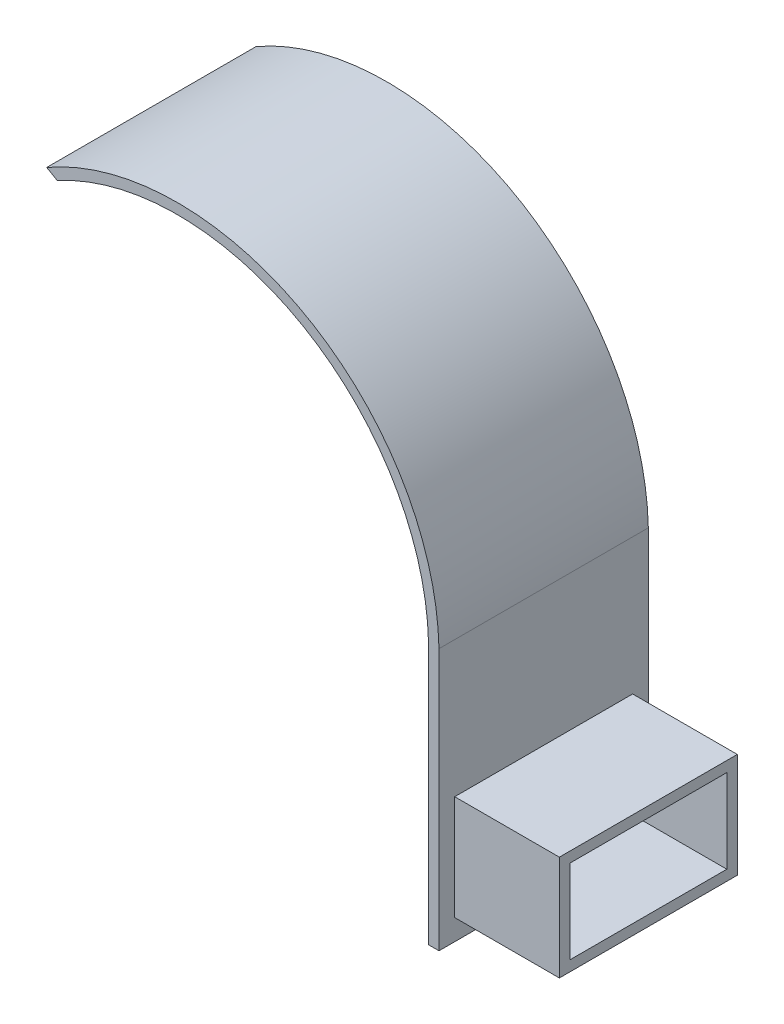
ISO-10303-21;
HEADER;
FILE_DESCRIPTION(('STEP AP214'),'2;1');
FILE_NAME('part.step','',(''),(''),'','','');
FILE_SCHEMA(('AUTOMOTIVE_DESIGN { 1 0 10303 214 1 1 1 1 }'));
ENDSEC;
DATA;
#1=APPLICATION_CONTEXT('core data for automotive mechanical design processes');
#2=APPLICATION_PROTOCOL_DEFINITION('international standard','automotive_design',2000,#1);
#3=PRODUCT_CONTEXT('',#1,'mechanical');
#4=PRODUCT('Part','Part','',(#3));
#5=PRODUCT_RELATED_PRODUCT_CATEGORY('part','',(#4));
#6=PRODUCT_DEFINITION_FORMATION('','',#4);
#7=PRODUCT_DEFINITION_CONTEXT('part definition',#1,'design');
#8=PRODUCT_DEFINITION('design','',#6,#7);
#9=PRODUCT_DEFINITION_SHAPE('','',#8);
#10=(LENGTH_UNIT() NAMED_UNIT(*) SI_UNIT(.MILLI.,.METRE.));
#11=(NAMED_UNIT(*) PLANE_ANGLE_UNIT() SI_UNIT($,.RADIAN.));
#12=(NAMED_UNIT(*) SI_UNIT($,.STERADIAN.) SOLID_ANGLE_UNIT());
#13=UNCERTAINTY_MEASURE_WITH_UNIT(LENGTH_MEASURE(1.E-05),#10,'distance_accuracy_value','');
#14=(GEOMETRIC_REPRESENTATION_CONTEXT(3) GLOBAL_UNCERTAINTY_ASSIGNED_CONTEXT((#13)) GLOBAL_UNIT_ASSIGNED_CONTEXT((#10,
#11,#12)) REPRESENTATION_CONTEXT('',''));
#15=CARTESIAN_POINT('',(0.,0.,0.));
#16=DIRECTION('',(0.,0.,1.));
#17=DIRECTION('',(1.,0.,0.));
#18=AXIS2_PLACEMENT_3D('',#15,#16,#17);
#19=CARTESIAN_POINT('',(24.9932296828144,-24.4182182350012,20.));
#20=DIRECTION('',(-1.,0.,0.));
#21=DIRECTION('',(0.,0.,1.));
#22=AXIS2_PLACEMENT_3D('',#19,#20,#21);
#23=PLANE('',#22);
#24=DIRECTION('',(0.,0.,-1.));
#25=VECTOR('',#24,1.);
#26=CARTESIAN_POINT('',(24.9932296828144,0.581781764998821,20.));
#27=LINE('',#26,#25);
#28=CARTESIAN_POINT('',(24.9932296828144,0.581781764998821,20.));
#29=VERTEX_POINT('',#28);
#30=CARTESIAN_POINT('',(24.9932296828144,0.581781764998821,0.));
#31=VERTEX_POINT('',#30);
#32=EDGE_CURVE('E269',#29,#31,#27,.T.);
#33=ORIENTED_EDGE('',*,*,#32,.F.);
#34=DIRECTION('',(0.,1.,0.));
#35=VECTOR('',#34,1.);
#36=CARTESIAN_POINT('',(24.9932296828144,-24.4182182350012,20.));
#37=LINE('',#36,#35);
#38=CARTESIAN_POINT('',(24.9932296828144,-24.4182182350012,20.));
#39=VERTEX_POINT('',#38);
#40=EDGE_CURVE('E257',#39,#29,#37,.T.);
#41=ORIENTED_EDGE('',*,*,#40,.F.);
#42=DIRECTION('',(0.,0.,1.));
#43=VECTOR('',#42,1.);
#44=CARTESIAN_POINT('',(24.9932296828144,-24.4182182350012,20.));
#45=LINE('',#44,#43);
#46=CARTESIAN_POINT('',(24.9932296828144,-24.4182182350012,0.));
#47=VERTEX_POINT('',#46);
#48=EDGE_CURVE('E247',#47,#39,#45,.T.);
#49=ORIENTED_EDGE('',*,*,#48,.F.);
#50=DIRECTION('',(0.,1.,0.));
#51=VECTOR('',#50,1.);
#52=CARTESIAN_POINT('',(24.9932296828144,-24.4182182350012,0.));
#53=LINE('',#52,#51);
#54=EDGE_CURVE('E261',#47,#31,#53,.T.);
#55=ORIENTED_EDGE('',*,*,#54,.T.);
#56=EDGE_LOOP('',(#33,#41,#49,#55));
#57=FACE_BOUND('',#56,.T.);
#58=DIRECTION('',(0.,-1.,0.));
#59=VECTOR('',#58,1.);
#60=CARTESIAN_POINT('',(24.9932296828144,-22.4182182350012,18.5));
#61=LINE('',#60,#59);
#62=CARTESIAN_POINT('',(24.9932296828144,-12.4182182350012,18.5));
#63=VERTEX_POINT('',#62);
#64=CARTESIAN_POINT('',(24.9932296828144,-22.4182182350012,18.5));
#65=VERTEX_POINT('',#64);
#66=EDGE_CURVE('E180',#63,#65,#61,.T.);
#67=ORIENTED_EDGE('',*,*,#66,.F.);
#68=DIRECTION('',(0.,0.,1.));
#69=VECTOR('',#68,1.);
#70=CARTESIAN_POINT('',(24.9932296828144,-12.4182182350012,18.5));
#71=LINE('',#70,#69);
#72=CARTESIAN_POINT('',(24.9932296828144,-12.4182182350012,1.5));
#73=VERTEX_POINT('',#72);
#74=EDGE_CURVE('E186',#73,#63,#71,.T.);
#75=ORIENTED_EDGE('',*,*,#74,.F.);
#76=DIRECTION('',(0.,1.,0.));
#77=VECTOR('',#76,1.);
#78=CARTESIAN_POINT('',(24.9932296828144,-22.4182182350012,1.5));
#79=LINE('',#78,#77);
#80=CARTESIAN_POINT('',(24.9932296828144,-22.4182182350012,1.5));
#81=VERTEX_POINT('',#80);
#82=EDGE_CURVE('E66',#81,#73,#79,.T.);
#83=ORIENTED_EDGE('',*,*,#82,.F.);
#84=DIRECTION('',(0.,0.,-1.));
#85=VECTOR('',#84,1.);
#86=CARTESIAN_POINT('',(24.9932296828144,-22.4182182350012,18.5));
#87=LINE('',#86,#85);
#88=EDGE_CURVE('E61',#65,#81,#87,.T.);
#89=ORIENTED_EDGE('',*,*,#88,.F.);
#90=EDGE_LOOP('',(#67,#75,#83,#89));
#91=FACE_BOUND('',#90,.T.);
#92=ADVANCED_FACE('F45',(#57,#91),#23,.F.);
#93=CARTESIAN_POINT('',(0.,0.,20.));
#94=DIRECTION('',(0.,0.,1.));
#95=DIRECTION('',(1.,0.,0.));
#96=AXIS2_PLACEMENT_3D('',#93,#94,#95);
#97=PLANE('',#96);
#98=CARTESIAN_POINT('',(0.,0.,20.));
#99=DIRECTION('',(0.,0.,1.));
#100=DIRECTION('',(1.,0.,0.));
#101=AXIS2_PLACEMENT_3D('',#98,#99,#100);
#102=CIRCLE('',#101,24.);
#103=CARTESIAN_POINT('',(23.9929475050048,0.581781764998821,20.));
#104=VERTEX_POINT('',#103);
#105=CARTESIAN_POINT('',(-11.4813465548932,21.0755469985109,20.));
#106=VERTEX_POINT('',#105);
#107=EDGE_CURVE('E285',#104,#106,#102,.T.);
#108=ORIENTED_EDGE('',*,*,#107,.F.);
#109=DIRECTION('',(0.,1.,0.));
#110=VECTOR('',#109,1.);
#111=CARTESIAN_POINT('',(23.9929475050048,-24.4182182350012,20.));
#112=LINE('',#111,#110);
#113=CARTESIAN_POINT('',(23.9929475050048,-24.4182182350012,20.));
#114=VERTEX_POINT('',#113);
#115=EDGE_CURVE('E253',#114,#104,#112,.T.);
#116=ORIENTED_EDGE('',*,*,#115,.F.);
#117=DIRECTION('',(-1.,0.,0.));
#118=VECTOR('',#117,1.);
#119=CARTESIAN_POINT('',(23.9929475050048,-24.4182182350012,20.));
#120=LINE('',#119,#118);
#121=EDGE_CURVE('E250',#39,#114,#120,.T.);
#122=ORIENTED_EDGE('',*,*,#121,.F.);
#123=ORIENTED_EDGE('',*,*,#40,.T.);
#124=CARTESIAN_POINT('',(0.,0.,20.));
#125=DIRECTION('',(0.,0.,1.));
#126=DIRECTION('',(1.,0.,0.));
#127=AXIS2_PLACEMENT_3D('',#124,#125,#126);
#128=CIRCLE('',#127,25.);
#129=CARTESIAN_POINT('',(-12.4883990498885,21.6573287635097,20.));
#130=VERTEX_POINT('',#129);
#131=EDGE_CURVE('E293',#29,#130,#128,.T.);
#132=ORIENTED_EDGE('',*,*,#131,.T.);
#133=DIRECTION('',(-0.86589143718931,0.500231965194379,0.));
#134=VECTOR('',#133,1.);
#135=CARTESIAN_POINT('',(-12.4883990498885,21.6573287635097,20.));
#136=LINE('',#135,#134);
#137=EDGE_CURVE('E272',#106,#130,#136,.T.);
#138=ORIENTED_EDGE('',*,*,#137,.F.);
#139=EDGE_LOOP('',(#108,#116,#122,#123,#132,#138));
#140=FACE_BOUND('',#139,.T.);
#141=ADVANCED_FACE('F305',(#140),#97,.T.);
#142=CARTESIAN_POINT('',(0.,0.,0.));
#143=DIRECTION('',(0.,0.,1.));
#144=DIRECTION('',(1.,0.,0.));
#145=AXIS2_PLACEMENT_3D('',#142,#143,#144);
#146=PLANE('',#145);
#147=CARTESIAN_POINT('',(0.,0.,0.));
#148=DIRECTION('',(0.,0.,1.));
#149=DIRECTION('',(1.,0.,0.));
#150=AXIS2_PLACEMENT_3D('',#147,#148,#149);
#151=CIRCLE('',#150,25.);
#152=CARTESIAN_POINT('',(-12.4883990498885,21.6573287635097,0.));
#153=VERTEX_POINT('',#152);
#154=EDGE_CURVE('E289',#31,#153,#151,.T.);
#155=ORIENTED_EDGE('',*,*,#154,.F.);
#156=ORIENTED_EDGE('',*,*,#54,.F.);
#157=DIRECTION('',(1.,0.,0.));
#158=VECTOR('',#157,1.);
#159=CARTESIAN_POINT('',(23.9929475050048,-24.4182182350012,0.));
#160=LINE('',#159,#158);
#161=CARTESIAN_POINT('',(23.9929475050048,-24.4182182350012,0.));
#162=VERTEX_POINT('',#161);
#163=EDGE_CURVE('E244',#162,#47,#160,.T.);
#164=ORIENTED_EDGE('',*,*,#163,.F.);
#165=DIRECTION('',(0.,1.,0.));
#166=VECTOR('',#165,1.);
#167=CARTESIAN_POINT('',(23.9929475050048,-24.4182182350012,0.));
#168=LINE('',#167,#166);
#169=CARTESIAN_POINT('',(23.9929475050048,0.581781764998821,0.));
#170=VERTEX_POINT('',#169);
#171=EDGE_CURVE('E265',#162,#170,#168,.T.);
#172=ORIENTED_EDGE('',*,*,#171,.T.);
#173=CARTESIAN_POINT('',(0.,0.,0.));
#174=DIRECTION('',(0.,0.,1.));
#175=DIRECTION('',(1.,0.,0.));
#176=AXIS2_PLACEMENT_3D('',#173,#174,#175);
#177=CIRCLE('',#176,24.);
#178=CARTESIAN_POINT('',(-11.4813465548932,21.0755469985109,0.));
#179=VERTEX_POINT('',#178);
#180=EDGE_CURVE('E284',#170,#179,#177,.T.);
#181=ORIENTED_EDGE('',*,*,#180,.T.);
#182=DIRECTION('',(-0.86589143718931,0.500231965194379,0.));
#183=VECTOR('',#182,1.);
#184=CARTESIAN_POINT('',(-12.4883990498885,21.6573287635097,0.));
#185=LINE('',#184,#183);
#186=EDGE_CURVE('E273',#179,#153,#185,.T.);
#187=ORIENTED_EDGE('',*,*,#186,.T.);
#188=EDGE_LOOP('',(#155,#156,#164,#172,#181,#187));
#189=FACE_BOUND('',#188,.T.);
#190=ADVANCED_FACE('F324',(#189),#146,.F.);
#191=CARTESIAN_POINT('',(0.,0.,20.));
#192=DIRECTION('',(0.,0.,-1.));
#193=DIRECTION('',(-1.,0.,0.));
#194=AXIS2_PLACEMENT_3D('',#191,#192,#193);
#195=CYLINDRICAL_SURFACE('',#194,25.);
#196=ORIENTED_EDGE('',*,*,#131,.F.);
#197=ORIENTED_EDGE('',*,*,#32,.T.);
#198=ORIENTED_EDGE('',*,*,#154,.T.);
#199=DIRECTION('',(0.,0.,1.));
#200=VECTOR('',#199,1.);
#201=CARTESIAN_POINT('',(-12.4883990498885,21.6573287635097,0.));
#202=LINE('',#201,#200);
#203=EDGE_CURVE('E277',#153,#130,#202,.T.);
#204=ORIENTED_EDGE('',*,*,#203,.T.);
#205=EDGE_LOOP('',(#196,#197,#198,#204));
#206=FACE_BOUND('',#205,.T.);
#207=ADVANCED_FACE('F47',(#206),#195,.T.);
#208=CARTESIAN_POINT('',(0.,0.,20.));
#209=DIRECTION('',(0.,0.,-1.));
#210=DIRECTION('',(-1.,0.,0.));
#211=AXIS2_PLACEMENT_3D('',#208,#209,#210);
#212=CYLINDRICAL_SURFACE('',#211,24.);
#213=DIRECTION('',(0.,0.,-1.));
#214=VECTOR('',#213,1.);
#215=CARTESIAN_POINT('',(23.9929475050048,0.581781764998821,20.));
#216=LINE('',#215,#214);
#217=EDGE_CURVE('E11',#104,#170,#216,.T.);
#218=ORIENTED_EDGE('',*,*,#217,.F.);
#219=ORIENTED_EDGE('',*,*,#107,.T.);
#220=DIRECTION('',(0.,0.,-1.));
#221=VECTOR('',#220,1.);
#222=CARTESIAN_POINT('',(-11.4813465548932,21.0755469985109,20.));
#223=LINE('',#222,#221);
#224=EDGE_CURVE('E54',#179,#106,#223,.F.);
#225=ORIENTED_EDGE('',*,*,#224,.F.);
#226=ORIENTED_EDGE('',*,*,#180,.F.);
#227=EDGE_LOOP('',(#218,#219,#225,#226));
#228=FACE_BOUND('',#227,.T.);
#229=ADVANCED_FACE('F308',(#228),#212,.F.);
#230=CARTESIAN_POINT('',(-12.4883990498885,21.6573287635097,0.));
#231=DIRECTION('',(0.500231965194379,0.86589143718931,0.));
#232=DIRECTION('',(-0.86589143718931,0.50023196519438,0.));
#233=AXIS2_PLACEMENT_3D('',#230,#231,#232);
#234=PLANE('',#233);
#235=ORIENTED_EDGE('',*,*,#224,.T.);
#236=ORIENTED_EDGE('',*,*,#137,.T.);
#237=ORIENTED_EDGE('',*,*,#203,.F.);
#238=ORIENTED_EDGE('',*,*,#186,.F.);
#239=EDGE_LOOP('',(#235,#236,#237,#238));
#240=FACE_BOUND('',#239,.T.);
#241=ADVANCED_FACE('F301',(#240),#234,.F.);
#242=CARTESIAN_POINT('',(23.9929475050048,-24.4182182350012,20.));
#243=DIRECTION('',(1.,0.,0.));
#244=DIRECTION('',(0.,0.,-1.));
#245=AXIS2_PLACEMENT_3D('',#242,#243,#244);
#246=PLANE('',#245);
#247=DIRECTION('',(0.,0.,1.));
#248=VECTOR('',#247,1.);
#249=CARTESIAN_POINT('',(23.9929475050048,-13.4182182350012,20.));
#250=LINE('',#249,#248);
#251=CARTESIAN_POINT('',(23.9929475050048,-13.4182182350012,2.5));
#252=VERTEX_POINT('',#251);
#253=CARTESIAN_POINT('',(23.9929475050048,-13.4182182350012,17.5));
#254=VERTEX_POINT('',#253);
#255=EDGE_CURVE('E153',#252,#254,#250,.T.);
#256=ORIENTED_EDGE('',*,*,#255,.T.);
#257=DIRECTION('',(0.,-1.,0.));
#258=VECTOR('',#257,1.);
#259=CARTESIAN_POINT('',(23.9929475050048,-24.4182182350012,17.5));
#260=LINE('',#259,#258);
#261=CARTESIAN_POINT('',(23.9929475050048,-21.4182182350012,17.5));
#262=VERTEX_POINT('',#261);
#263=EDGE_CURVE('E236',#254,#262,#260,.T.);
#264=ORIENTED_EDGE('',*,*,#263,.T.);
#265=DIRECTION('',(0.,0.,-1.));
#266=VECTOR('',#265,1.);
#267=CARTESIAN_POINT('',(23.9929475050048,-21.4182182350012,20.));
#268=LINE('',#267,#266);
#269=CARTESIAN_POINT('',(23.9929475050048,-21.4182182350012,2.5));
#270=VERTEX_POINT('',#269);
#271=EDGE_CURVE('E222',#262,#270,#268,.T.);
#272=ORIENTED_EDGE('',*,*,#271,.T.);
#273=DIRECTION('',(0.,1.,0.));
#274=VECTOR('',#273,1.);
#275=CARTESIAN_POINT('',(23.9929475050048,-24.4182182350012,2.5));
#276=LINE('',#275,#274);
#277=EDGE_CURVE('E231',#270,#252,#276,.T.);
#278=ORIENTED_EDGE('',*,*,#277,.T.);
#279=EDGE_LOOP('',(#256,#264,#272,#278));
#280=FACE_BOUND('',#279,.T.);
#281=ORIENTED_EDGE('',*,*,#217,.T.);
#282=ORIENTED_EDGE('',*,*,#171,.F.);
#283=DIRECTION('',(0.,0.,-1.));
#284=VECTOR('',#283,1.);
#285=CARTESIAN_POINT('',(23.9929475050048,-24.4182182350012,20.));
#286=LINE('',#285,#284);
#287=EDGE_CURVE('E240',#114,#162,#286,.T.);
#288=ORIENTED_EDGE('',*,*,#287,.F.);
#289=ORIENTED_EDGE('',*,*,#115,.T.);
#290=EDGE_LOOP('',(#281,#282,#288,#289));
#291=FACE_BOUND('',#290,.T.);
#292=ADVANCED_FACE('F312',(#280,#291),#246,.F.);
#293=CARTESIAN_POINT('',(0.,-24.4182182350012,0.));
#294=DIRECTION('',(0.,-1.,0.));
#295=DIRECTION('',(0.,0.,-1.));
#296=AXIS2_PLACEMENT_3D('',#293,#294,#295);
#297=PLANE('',#296);
#298=ORIENTED_EDGE('',*,*,#287,.T.);
#299=ORIENTED_EDGE('',*,*,#163,.T.);
#300=ORIENTED_EDGE('',*,*,#48,.T.);
#301=ORIENTED_EDGE('',*,*,#121,.T.);
#302=EDGE_LOOP('',(#298,#299,#300,#301));
#303=FACE_BOUND('',#302,.T.);
#304=ADVANCED_FACE('F316',(#303),#297,.T.);
#305=CARTESIAN_POINT('',(-12.4883990498885,-21.4182182350012,17.5));
#306=DIRECTION('',(0.,0.,1.));
#307=DIRECTION('',(1.,0.,0.));
#308=AXIS2_PLACEMENT_3D('',#305,#306,#307);
#309=PLANE('',#308);
#310=DIRECTION('',(1.,0.,0.));
#311=VECTOR('',#310,1.);
#312=CARTESIAN_POINT('',(-12.4883990498885,-13.4182182350012,17.5));
#313=LINE('',#312,#311);
#314=CARTESIAN_POINT('',(34.9932296828144,-13.4182182350012,17.5));
#315=VERTEX_POINT('',#314);
#316=EDGE_CURVE('E158',#254,#315,#313,.T.);
#317=ORIENTED_EDGE('',*,*,#316,.T.);
#318=DIRECTION('',(0.,-1.,0.));
#319=VECTOR('',#318,1.);
#320=CARTESIAN_POINT('',(34.9932296828144,-13.4182182350012,17.5));
#321=LINE('',#320,#319);
#322=CARTESIAN_POINT('',(34.9932296828144,-21.4182182350012,17.5));
#323=VERTEX_POINT('',#322);
#324=EDGE_CURVE('E171',#315,#323,#321,.T.);
#325=ORIENTED_EDGE('',*,*,#324,.T.);
#326=DIRECTION('',(1.,0.,0.));
#327=VECTOR('',#326,1.);
#328=CARTESIAN_POINT('',(-12.4883990498885,-21.4182182350012,17.5));
#329=LINE('',#328,#327);
#330=EDGE_CURVE('E220',#262,#323,#329,.T.);
#331=ORIENTED_EDGE('',*,*,#330,.F.);
#332=ORIENTED_EDGE('',*,*,#263,.F.);
#333=EDGE_LOOP('',(#317,#325,#331,#332));
#334=FACE_BOUND('',#333,.T.);
#335=ADVANCED_FACE('F356',(#334),#309,.F.);
#336=CARTESIAN_POINT('',(-12.4883990498885,-13.4182182350012,17.5));
#337=DIRECTION('',(0.,1.,0.));
#338=DIRECTION('',(0.,0.,1.));
#339=AXIS2_PLACEMENT_3D('',#336,#337,#338);
#340=PLANE('',#339);
#341=DIRECTION('',(1.,0.,0.));
#342=VECTOR('',#341,1.);
#343=CARTESIAN_POINT('',(-12.4883990498885,-13.4182182350012,2.5));
#344=LINE('',#343,#342);
#345=CARTESIAN_POINT('',(34.9932296828144,-13.4182182350012,2.5));
#346=VERTEX_POINT('',#345);
#347=EDGE_CURVE('E145',#252,#346,#344,.T.);
#348=ORIENTED_EDGE('',*,*,#347,.T.);
#349=DIRECTION('',(0.,0.,1.));
#350=VECTOR('',#349,1.);
#351=CARTESIAN_POINT('',(34.9932296828144,-13.4182182350012,2.5));
#352=LINE('',#351,#350);
#353=EDGE_CURVE('E150',#346,#315,#352,.T.);
#354=ORIENTED_EDGE('',*,*,#353,.T.);
#355=ORIENTED_EDGE('',*,*,#316,.F.);
#356=ORIENTED_EDGE('',*,*,#255,.F.);
#357=EDGE_LOOP('',(#348,#354,#355,#356));
#358=FACE_BOUND('',#357,.T.);
#359=ADVANCED_FACE('F147',(#358),#340,.F.);
#360=CARTESIAN_POINT('',(-12.4883990498885,-21.4182182350012,2.5));
#361=DIRECTION('',(0.,0.,-1.));
#362=DIRECTION('',(-1.,0.,0.));
#363=AXIS2_PLACEMENT_3D('',#360,#361,#362);
#364=PLANE('',#363);
#365=DIRECTION('',(1.,0.,0.));
#366=VECTOR('',#365,1.);
#367=CARTESIAN_POINT('',(-12.4883990498885,-21.4182182350012,2.5));
#368=LINE('',#367,#366);
#369=CARTESIAN_POINT('',(34.9932296828144,-21.4182182350012,2.5));
#370=VERTEX_POINT('',#369);
#371=EDGE_CURVE('E159',#270,#370,#368,.T.);
#372=ORIENTED_EDGE('',*,*,#371,.T.);
#373=DIRECTION('',(0.,1.,0.));
#374=VECTOR('',#373,1.);
#375=CARTESIAN_POINT('',(34.9932296828144,-21.4182182350012,2.5));
#376=LINE('',#375,#374);
#377=EDGE_CURVE('E162',#370,#346,#376,.T.);
#378=ORIENTED_EDGE('',*,*,#377,.T.);
#379=ORIENTED_EDGE('',*,*,#347,.F.);
#380=ORIENTED_EDGE('',*,*,#277,.F.);
#381=EDGE_LOOP('',(#372,#378,#379,#380));
#382=FACE_BOUND('',#381,.T.);
#383=ADVANCED_FACE('F163',(#382),#364,.F.);
#384=CARTESIAN_POINT('',(-12.4883990498885,-21.4182182350012,17.5));
#385=DIRECTION('',(0.,-1.,0.));
#386=DIRECTION('',(0.,0.,-1.));
#387=AXIS2_PLACEMENT_3D('',#384,#385,#386);
#388=PLANE('',#387);
#389=ORIENTED_EDGE('',*,*,#330,.T.);
#390=DIRECTION('',(0.,0.,-1.));
#391=VECTOR('',#390,1.);
#392=CARTESIAN_POINT('',(34.9932296828144,-21.4182182350012,17.5));
#393=LINE('',#392,#391);
#394=EDGE_CURVE('E175',#323,#370,#393,.T.);
#395=ORIENTED_EDGE('',*,*,#394,.T.);
#396=ORIENTED_EDGE('',*,*,#371,.F.);
#397=ORIENTED_EDGE('',*,*,#271,.F.);
#398=EDGE_LOOP('',(#389,#395,#396,#397));
#399=FACE_BOUND('',#398,.T.);
#400=ADVANCED_FACE('F413',(#399),#388,.F.);
#401=CARTESIAN_POINT('',(34.9932296828144,0.,0.));
#402=DIRECTION('',(-1.,0.,0.));
#403=DIRECTION('',(0.,0.,1.));
#404=AXIS2_PLACEMENT_3D('',#401,#402,#403);
#405=PLANE('',#404);
#406=DIRECTION('',(0.,-1.,0.));
#407=VECTOR('',#406,1.);
#408=CARTESIAN_POINT('',(34.9932296828144,-22.4182182350012,18.5));
#409=LINE('',#408,#407);
#410=CARTESIAN_POINT('',(34.9932296828144,-12.4182182350012,18.5));
#411=VERTEX_POINT('',#410);
#412=CARTESIAN_POINT('',(34.9932296828144,-22.4182182350012,18.5));
#413=VERTEX_POINT('',#412);
#414=EDGE_CURVE('E181',#411,#413,#409,.T.);
#415=ORIENTED_EDGE('',*,*,#414,.T.);
#416=DIRECTION('',(0.,0.,-1.));
#417=VECTOR('',#416,1.);
#418=CARTESIAN_POINT('',(34.9932296828144,-22.4182182350012,18.5));
#419=LINE('',#418,#417);
#420=CARTESIAN_POINT('',(34.9932296828144,-22.4182182350012,1.5));
#421=VERTEX_POINT('',#420);
#422=EDGE_CURVE('E185',#413,#421,#419,.T.);
#423=ORIENTED_EDGE('',*,*,#422,.T.);
#424=DIRECTION('',(0.,1.,0.));
#425=VECTOR('',#424,1.);
#426=CARTESIAN_POINT('',(34.9932296828144,-22.4182182350012,1.5));
#427=LINE('',#426,#425);
#428=CARTESIAN_POINT('',(34.9932296828144,-12.4182182350012,1.5));
#429=VERTEX_POINT('',#428);
#430=EDGE_CURVE('E189',#421,#429,#427,.T.);
#431=ORIENTED_EDGE('',*,*,#430,.T.);
#432=DIRECTION('',(0.,0.,1.));
#433=VECTOR('',#432,1.);
#434=CARTESIAN_POINT('',(34.9932296828144,-12.4182182350012,18.5));
#435=LINE('',#434,#433);
#436=EDGE_CURVE('E192',#429,#411,#435,.T.);
#437=ORIENTED_EDGE('',*,*,#436,.T.);
#438=EDGE_LOOP('',(#415,#423,#431,#437));
#439=FACE_BOUND('',#438,.T.);
#440=ORIENTED_EDGE('',*,*,#377,.F.);
#441=ORIENTED_EDGE('',*,*,#394,.F.);
#442=ORIENTED_EDGE('',*,*,#324,.F.);
#443=ORIENTED_EDGE('',*,*,#353,.F.);
#444=EDGE_LOOP('',(#440,#441,#442,#443));
#445=FACE_BOUND('',#444,.T.);
#446=ADVANCED_FACE('F169',(#439,#445),#405,.F.);
#447=CARTESIAN_POINT('',(34.9932296828144,-22.4182182350012,18.5));
#448=DIRECTION('',(0.,0.,-1.));
#449=DIRECTION('',(-1.,0.,0.));
#450=AXIS2_PLACEMENT_3D('',#447,#448,#449);
#451=PLANE('',#450);
#452=ORIENTED_EDGE('',*,*,#66,.T.);
#453=DIRECTION('',(-1.,0.,0.));
#454=VECTOR('',#453,1.);
#455=CARTESIAN_POINT('',(34.9932296828144,-22.4182182350012,18.5));
#456=LINE('',#455,#454);
#457=EDGE_CURVE('E217',#413,#65,#456,.T.);
#458=ORIENTED_EDGE('',*,*,#457,.F.);
#459=ORIENTED_EDGE('',*,*,#414,.F.);
#460=DIRECTION('',(-1.,0.,0.));
#461=VECTOR('',#460,1.);
#462=CARTESIAN_POINT('',(34.9932296828144,-12.4182182350012,18.5));
#463=LINE('',#462,#461);
#464=EDGE_CURVE('E195',#411,#63,#463,.T.);
#465=ORIENTED_EDGE('',*,*,#464,.T.);
#466=EDGE_LOOP('',(#452,#458,#459,#465));
#467=FACE_BOUND('',#466,.T.);
#468=ADVANCED_FACE('F435',(#467),#451,.F.);
#469=CARTESIAN_POINT('',(34.9932296828144,-22.4182182350012,18.5));
#470=DIRECTION('',(0.,1.,0.));
#471=DIRECTION('',(0.,0.,1.));
#472=AXIS2_PLACEMENT_3D('',#469,#470,#471);
#473=PLANE('',#472);
#474=ORIENTED_EDGE('',*,*,#88,.T.);
#475=DIRECTION('',(-1.,0.,0.));
#476=VECTOR('',#475,1.);
#477=CARTESIAN_POINT('',(34.9932296828144,-22.4182182350012,1.5));
#478=LINE('',#477,#476);
#479=EDGE_CURVE('E213',#421,#81,#478,.T.);
#480=ORIENTED_EDGE('',*,*,#479,.F.);
#481=ORIENTED_EDGE('',*,*,#422,.F.);
#482=ORIENTED_EDGE('',*,*,#457,.T.);
#483=EDGE_LOOP('',(#474,#480,#481,#482));
#484=FACE_BOUND('',#483,.T.);
#485=ADVANCED_FACE('F444',(#484),#473,.F.);
#486=CARTESIAN_POINT('',(34.9932296828144,-22.4182182350012,1.5));
#487=DIRECTION('',(0.,0.,1.));
#488=DIRECTION('',(1.,0.,0.));
#489=AXIS2_PLACEMENT_3D('',#486,#487,#488);
#490=PLANE('',#489);
#491=ORIENTED_EDGE('',*,*,#82,.T.);
#492=DIRECTION('',(-1.,0.,0.));
#493=VECTOR('',#492,1.);
#494=CARTESIAN_POINT('',(34.9932296828144,-12.4182182350012,1.5));
#495=LINE('',#494,#493);
#496=EDGE_CURVE('E209',#429,#73,#495,.T.);
#497=ORIENTED_EDGE('',*,*,#496,.F.);
#498=ORIENTED_EDGE('',*,*,#430,.F.);
#499=ORIENTED_EDGE('',*,*,#479,.T.);
#500=EDGE_LOOP('',(#491,#497,#498,#499));
#501=FACE_BOUND('',#500,.T.);
#502=ADVANCED_FACE('F453',(#501),#490,.F.);
#503=CARTESIAN_POINT('',(34.9932296828144,-12.4182182350012,18.5));
#504=DIRECTION('',(0.,-1.,0.));
#505=DIRECTION('',(0.,0.,-1.));
#506=AXIS2_PLACEMENT_3D('',#503,#504,#505);
#507=PLANE('',#506);
#508=ORIENTED_EDGE('',*,*,#74,.T.);
#509=ORIENTED_EDGE('',*,*,#464,.F.);
#510=ORIENTED_EDGE('',*,*,#436,.F.);
#511=ORIENTED_EDGE('',*,*,#496,.T.);
#512=EDGE_LOOP('',(#508,#509,#510,#511));
#513=FACE_BOUND('',#512,.T.);
#514=ADVANCED_FACE('F462',(#513),#507,.F.);
#515=CLOSED_SHELL('',(#92,#141,#190,#207,#229,#241,#292,#304,#335,#359,#383,#400,#446,#468,#485,
#502,#514));
#516=MANIFOLD_SOLID_BREP('B2',#515);
#517=ADVANCED_BREP_SHAPE_REPRESENTATION('',(#18,#516),#14);
#518=SHAPE_DEFINITION_REPRESENTATION(#9,#517);
ENDSEC;
END-ISO-10303-21;
